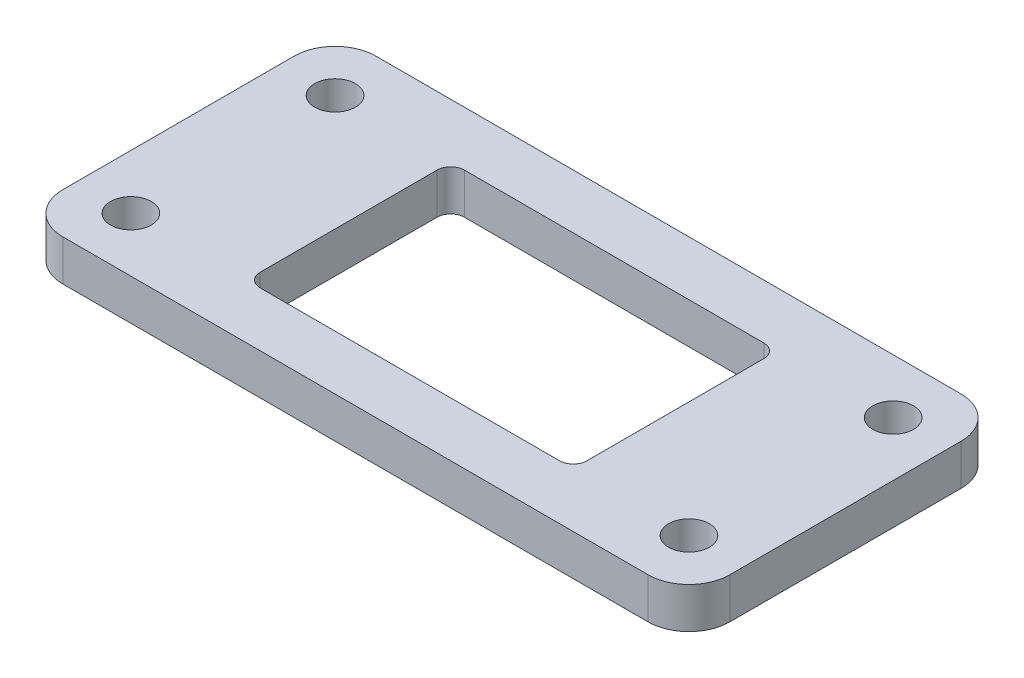
ISO-10303-21;
HEADER;
FILE_DESCRIPTION(('STEP AP214'),'2;1');
FILE_NAME('part.step','',(''),(''),'','','');
FILE_SCHEMA(('AUTOMOTIVE_DESIGN { 1 0 10303 214 1 1 1 1 }'));
ENDSEC;
DATA;
#1=APPLICATION_CONTEXT('core data for automotive mechanical design processes');
#2=APPLICATION_PROTOCOL_DEFINITION('international standard','automotive_design',2000,#1);
#3=PRODUCT_CONTEXT('',#1,'mechanical');
#4=PRODUCT('Part','Part','',(#3));
#5=PRODUCT_RELATED_PRODUCT_CATEGORY('part','',(#4));
#6=PRODUCT_DEFINITION_FORMATION('','',#4);
#7=PRODUCT_DEFINITION_CONTEXT('part definition',#1,'design');
#8=PRODUCT_DEFINITION('design','',#6,#7);
#9=PRODUCT_DEFINITION_SHAPE('','',#8);
#10=(LENGTH_UNIT() NAMED_UNIT(*) SI_UNIT(.MILLI.,.METRE.));
#11=(NAMED_UNIT(*) PLANE_ANGLE_UNIT() SI_UNIT($,.RADIAN.));
#12=(NAMED_UNIT(*) SI_UNIT($,.STERADIAN.) SOLID_ANGLE_UNIT());
#13=UNCERTAINTY_MEASURE_WITH_UNIT(LENGTH_MEASURE(1.E-05),#10,'distance_accuracy_value','');
#14=(GEOMETRIC_REPRESENTATION_CONTEXT(3) GLOBAL_UNCERTAINTY_ASSIGNED_CONTEXT((#13)) GLOBAL_UNIT_ASSIGNED_CONTEXT((#10,
#11,#12)) REPRESENTATION_CONTEXT('',''));
#15=CARTESIAN_POINT('',(0.,0.,0.));
#16=DIRECTION('',(0.,0.,1.));
#17=DIRECTION('',(1.,0.,0.));
#18=AXIS2_PLACEMENT_3D('',#15,#16,#17);
#19=CARTESIAN_POINT('',(-1.,3.,16.));
#20=DIRECTION('',(0.,-1.,0.));
#21=DIRECTION('',(0.,0.,-1.));
#22=AXIS2_PLACEMENT_3D('',#19,#20,#21);
#23=PLANE('',#22);
#24=CARTESIAN_POINT('',(0.,3.,15.));
#25=DIRECTION('',(0.,1.,0.));
#26=DIRECTION('',(0.,0.,1.));
#27=AXIS2_PLACEMENT_3D('',#24,#25,#26);
#28=CIRCLE('',#27,1.5);
#29=CARTESIAN_POINT('',(0.,3.,16.5));
#30=VERTEX_POINT('',#29);
#31=EDGE_CURVE('E210',#30,#30,#28,.T.);
#32=ORIENTED_EDGE('',*,*,#31,.F.);
#33=EDGE_LOOP('',(#32));
#34=FACE_BOUND('',#33,.T.);
#35=CARTESIAN_POINT('',(41.,3.,0.));
#36=DIRECTION('',(0.,1.,0.));
#37=DIRECTION('',(0.,0.,1.));
#38=AXIS2_PLACEMENT_3D('',#35,#36,#37);
#39=CIRCLE('',#38,1.5);
#40=CARTESIAN_POINT('',(41.,3.,1.5));
#41=VERTEX_POINT('',#40);
#42=EDGE_CURVE('E222',#41,#41,#39,.T.);
#43=ORIENTED_EDGE('',*,*,#42,.F.);
#44=EDGE_LOOP('',(#43));
#45=FACE_BOUND('',#44,.T.);
#46=CARTESIAN_POINT('',(-1.,3.,16.));
#47=DIRECTION('',(0.,1.,0.));
#48=DIRECTION('',(0.,0.,-1.));
#49=AXIS2_PLACEMENT_3D('',#46,#47,#48);
#50=CIRCLE('',#49,3.);
#51=CARTESIAN_POINT('',(-4.,3.,16.));
#52=VERTEX_POINT('',#51);
#53=CARTESIAN_POINT('',(-0.999999999999979,3.,19.));
#54=VERTEX_POINT('',#53);
#55=EDGE_CURVE('E234',#52,#54,#50,.T.);
#56=ORIENTED_EDGE('',*,*,#55,.T.);
#57=DIRECTION('',(1.,0.,0.));
#58=VECTOR('',#57,1.);
#59=CARTESIAN_POINT('',(-0.999999999999979,3.,19.));
#60=LINE('',#59,#58);
#61=CARTESIAN_POINT('',(42.,3.,19.));
#62=VERTEX_POINT('',#61);
#63=EDGE_CURVE('E237',#54,#62,#60,.T.);
#64=ORIENTED_EDGE('',*,*,#63,.T.);
#65=CARTESIAN_POINT('',(42.,3.,16.));
#66=DIRECTION('',(0.,1.,0.));
#67=DIRECTION('',(0.,0.,1.));
#68=AXIS2_PLACEMENT_3D('',#65,#66,#67);
#69=CIRCLE('',#68,3.);
#70=CARTESIAN_POINT('',(45.,3.,16.));
#71=VERTEX_POINT('',#70);
#72=EDGE_CURVE('E240',#62,#71,#69,.T.);
#73=ORIENTED_EDGE('',*,*,#72,.T.);
#74=DIRECTION('',(0.,0.,-1.));
#75=VECTOR('',#74,1.);
#76=CARTESIAN_POINT('',(45.,3.,-0.99999999999998));
#77=LINE('',#76,#75);
#78=CARTESIAN_POINT('',(45.,3.,-0.99999999999998));
#79=VERTEX_POINT('',#78);
#80=EDGE_CURVE('E242',#71,#79,#77,.T.);
#81=ORIENTED_EDGE('',*,*,#80,.T.);
#82=CARTESIAN_POINT('',(42.,3.,-1.));
#83=DIRECTION('',(0.,1.,0.));
#84=DIRECTION('',(0.,0.,-1.));
#85=AXIS2_PLACEMENT_3D('',#82,#83,#84);
#86=CIRCLE('',#85,3.);
#87=CARTESIAN_POINT('',(42.,3.,-4.));
#88=VERTEX_POINT('',#87);
#89=EDGE_CURVE('E244',#79,#88,#86,.T.);
#90=ORIENTED_EDGE('',*,*,#89,.T.);
#91=DIRECTION('',(-1.,0.,0.));
#92=VECTOR('',#91,1.);
#93=CARTESIAN_POINT('',(-0.999999999999979,3.,-4.));
#94=LINE('',#93,#92);
#95=CARTESIAN_POINT('',(-0.999999999999979,3.,-4.));
#96=VERTEX_POINT('',#95);
#97=EDGE_CURVE('E246',#88,#96,#94,.T.);
#98=ORIENTED_EDGE('',*,*,#97,.T.);
#99=CARTESIAN_POINT('',(-1.,3.,-1.));
#100=DIRECTION('',(0.,1.,0.));
#101=DIRECTION('',(0.,0.,1.));
#102=AXIS2_PLACEMENT_3D('',#99,#100,#101);
#103=CIRCLE('',#102,3.);
#104=CARTESIAN_POINT('',(-4.,3.,-0.999999999999979));
#105=VERTEX_POINT('',#104);
#106=EDGE_CURVE('E248',#96,#105,#103,.T.);
#107=ORIENTED_EDGE('',*,*,#106,.T.);
#108=DIRECTION('',(0.,0.,1.));
#109=VECTOR('',#108,1.);
#110=CARTESIAN_POINT('',(-4.,3.,-0.999999999999979));
#111=LINE('',#110,#109);
#112=EDGE_CURVE('E250',#105,#52,#111,.T.);
#113=ORIENTED_EDGE('',*,*,#112,.T.);
#114=EDGE_LOOP('',(#56,#64,#73,#81,#90,#98,#107,#113));
#115=FACE_BOUND('',#114,.T.);
#116=CARTESIAN_POINT('',(0.,3.,0.));
#117=DIRECTION('',(0.,1.,0.));
#118=DIRECTION('',(0.,0.,1.));
#119=AXIS2_PLACEMENT_3D('',#116,#117,#118);
#120=CIRCLE('',#119,1.5);
#121=CARTESIAN_POINT('',(0.,3.,1.5));
#122=VERTEX_POINT('',#121);
#123=EDGE_CURVE('E228',#122,#122,#120,.T.);
#124=ORIENTED_EDGE('',*,*,#123,.F.);
#125=EDGE_LOOP('',(#124));
#126=FACE_BOUND('',#125,.T.);
#127=CARTESIAN_POINT('',(41.,3.,15.));
#128=DIRECTION('',(0.,1.,0.));
#129=DIRECTION('',(0.,0.,1.));
#130=AXIS2_PLACEMENT_3D('',#127,#128,#129);
#131=CIRCLE('',#130,1.5);
#132=CARTESIAN_POINT('',(41.,3.,16.5));
#133=VERTEX_POINT('',#132);
#134=EDGE_CURVE('E216',#133,#133,#131,.T.);
#135=ORIENTED_EDGE('',*,*,#134,.F.);
#136=EDGE_LOOP('',(#135));
#137=FACE_BOUND('',#136,.T.);
#138=CARTESIAN_POINT('',(9.50000000000005,3.,14.));
#139=DIRECTION('',(0.,1.,0.));
#140=DIRECTION('',(0.,0.,1.));
#141=AXIS2_PLACEMENT_3D('',#138,#139,#140);
#142=CIRCLE('',#141,1.);
#143=CARTESIAN_POINT('',(8.50000000000005,3.,14.));
#144=VERTEX_POINT('',#143);
#145=CARTESIAN_POINT('',(9.50000000000006,3.,15.));
#146=VERTEX_POINT('',#145);
#147=EDGE_CURVE('E145',#144,#146,#142,.T.);
#148=ORIENTED_EDGE('',*,*,#147,.F.);
#149=DIRECTION('',(0.,0.,1.));
#150=VECTOR('',#149,1.);
#151=CARTESIAN_POINT('',(8.50000000000005,3.,1.00000000000001));
#152=LINE('',#151,#150);
#153=CARTESIAN_POINT('',(8.50000000000005,3.,1.00000000000001));
#154=VERTEX_POINT('',#153);
#155=EDGE_CURVE('E178',#154,#144,#152,.T.);
#156=ORIENTED_EDGE('',*,*,#155,.F.);
#157=CARTESIAN_POINT('',(9.50000000000005,3.,1.));
#158=DIRECTION('',(0.,1.,0.));
#159=DIRECTION('',(0.,0.,1.));
#160=AXIS2_PLACEMENT_3D('',#157,#158,#159);
#161=CIRCLE('',#160,1.);
#162=CARTESIAN_POINT('',(9.50000000000006,3.,0.));
#163=VERTEX_POINT('',#162);
#164=EDGE_CURVE('E176',#163,#154,#161,.T.);
#165=ORIENTED_EDGE('',*,*,#164,.F.);
#166=DIRECTION('',(-1.,0.,0.));
#167=VECTOR('',#166,1.);
#168=CARTESIAN_POINT('',(9.50000000000006,3.,0.));
#169=LINE('',#168,#167);
#170=CARTESIAN_POINT('',(31.5,3.,0.));
#171=VERTEX_POINT('',#170);
#172=EDGE_CURVE('E174',#171,#163,#169,.T.);
#173=ORIENTED_EDGE('',*,*,#172,.F.);
#174=CARTESIAN_POINT('',(31.5,3.,1.));
#175=DIRECTION('',(0.,1.,0.));
#176=DIRECTION('',(0.,0.,-1.));
#177=AXIS2_PLACEMENT_3D('',#174,#175,#176);
#178=CIRCLE('',#177,1.);
#179=CARTESIAN_POINT('',(32.5,3.,1.00000000000001));
#180=VERTEX_POINT('',#179);
#181=EDGE_CURVE('E172',#180,#171,#178,.T.);
#182=ORIENTED_EDGE('',*,*,#181,.F.);
#183=DIRECTION('',(0.,0.,-1.));
#184=VECTOR('',#183,1.);
#185=CARTESIAN_POINT('',(32.5,3.,1.00000000000001));
#186=LINE('',#185,#184);
#187=CARTESIAN_POINT('',(32.5,3.,14.));
#188=VERTEX_POINT('',#187);
#189=EDGE_CURVE('E168',#188,#180,#186,.T.);
#190=ORIENTED_EDGE('',*,*,#189,.F.);
#191=CARTESIAN_POINT('',(31.5,3.,14.));
#192=DIRECTION('',(0.,1.,0.));
#193=DIRECTION('',(0.,0.,1.));
#194=AXIS2_PLACEMENT_3D('',#191,#192,#193);
#195=CIRCLE('',#194,1.);
#196=CARTESIAN_POINT('',(31.5,3.,15.));
#197=VERTEX_POINT('',#196);
#198=EDGE_CURVE('E166',#197,#188,#195,.T.);
#199=ORIENTED_EDGE('',*,*,#198,.F.);
#200=DIRECTION('',(1.,0.,0.));
#201=VECTOR('',#200,1.);
#202=CARTESIAN_POINT('',(9.50000000000006,3.,15.));
#203=LINE('',#202,#201);
#204=EDGE_CURVE('E153',#146,#197,#203,.T.);
#205=ORIENTED_EDGE('',*,*,#204,.F.);
#206=EDGE_LOOP('',(#148,#156,#165,#173,#182,#190,#199,#205));
#207=FACE_BOUND('',#206,.T.);
#208=ADVANCED_FACE('F32',(#34,#45,#115,#126,#137,#207),#23,.F.);
#209=CARTESIAN_POINT('',(-1.,0.,16.));
#210=DIRECTION('',(0.,-1.,0.));
#211=DIRECTION('',(0.,0.,-1.));
#212=AXIS2_PLACEMENT_3D('',#209,#210,#211);
#213=PLANE('',#212);
#214=CARTESIAN_POINT('',(0.,0.,15.));
#215=DIRECTION('',(0.,1.,0.));
#216=DIRECTION('',(0.,0.,1.));
#217=AXIS2_PLACEMENT_3D('',#214,#215,#216);
#218=CIRCLE('',#217,1.5);
#219=CARTESIAN_POINT('',(0.,0.,16.5));
#220=VERTEX_POINT('',#219);
#221=EDGE_CURVE('E161',#220,#220,#218,.T.);
#222=ORIENTED_EDGE('',*,*,#221,.T.);
#223=EDGE_LOOP('',(#222));
#224=FACE_BOUND('',#223,.T.);
#225=CARTESIAN_POINT('',(41.,0.,0.));
#226=DIRECTION('',(0.,1.,0.));
#227=DIRECTION('',(0.,0.,1.));
#228=AXIS2_PLACEMENT_3D('',#225,#226,#227);
#229=CIRCLE('',#228,1.5);
#230=CARTESIAN_POINT('',(41.,0.,1.5));
#231=VERTEX_POINT('',#230);
#232=EDGE_CURVE('E219',#231,#231,#229,.T.);
#233=ORIENTED_EDGE('',*,*,#232,.T.);
#234=EDGE_LOOP('',(#233));
#235=FACE_BOUND('',#234,.T.);
#236=CARTESIAN_POINT('',(-1.,0.,16.));
#237=DIRECTION('',(0.,1.,0.));
#238=DIRECTION('',(0.,0.,-1.));
#239=AXIS2_PLACEMENT_3D('',#236,#237,#238);
#240=CIRCLE('',#239,3.);
#241=CARTESIAN_POINT('',(-4.,0.,16.));
#242=VERTEX_POINT('',#241);
#243=CARTESIAN_POINT('',(-0.999999999999979,0.,19.));
#244=VERTEX_POINT('',#243);
#245=EDGE_CURVE('E231',#242,#244,#240,.T.);
#246=ORIENTED_EDGE('',*,*,#245,.F.);
#247=DIRECTION('',(0.,0.,1.));
#248=VECTOR('',#247,1.);
#249=CARTESIAN_POINT('',(-4.,0.,-0.999999999999979));
#250=LINE('',#249,#248);
#251=CARTESIAN_POINT('',(-4.,0.,-0.999999999999979));
#252=VERTEX_POINT('',#251);
#253=EDGE_CURVE('E238',#252,#242,#250,.T.);
#254=ORIENTED_EDGE('',*,*,#253,.F.);
#255=CARTESIAN_POINT('',(-1.,0.,-1.));
#256=DIRECTION('',(0.,1.,0.));
#257=DIRECTION('',(0.,0.,1.));
#258=AXIS2_PLACEMENT_3D('',#255,#256,#257);
#259=CIRCLE('',#258,3.);
#260=CARTESIAN_POINT('',(-0.999999999999979,0.,-4.));
#261=VERTEX_POINT('',#260);
#262=EDGE_CURVE('E265',#261,#252,#259,.T.);
#263=ORIENTED_EDGE('',*,*,#262,.F.);
#264=DIRECTION('',(-1.,0.,0.));
#265=VECTOR('',#264,1.);
#266=CARTESIAN_POINT('',(-0.999999999999979,0.,-4.));
#267=LINE('',#266,#265);
#268=CARTESIAN_POINT('',(42.,0.,-4.));
#269=VERTEX_POINT('',#268);
#270=EDGE_CURVE('E263',#269,#261,#267,.T.);
#271=ORIENTED_EDGE('',*,*,#270,.F.);
#272=CARTESIAN_POINT('',(42.,0.,-1.));
#273=DIRECTION('',(0.,1.,0.));
#274=DIRECTION('',(0.,0.,-1.));
#275=AXIS2_PLACEMENT_3D('',#272,#273,#274);
#276=CIRCLE('',#275,3.);
#277=CARTESIAN_POINT('',(45.,0.,-0.99999999999998));
#278=VERTEX_POINT('',#277);
#279=EDGE_CURVE('E261',#278,#269,#276,.T.);
#280=ORIENTED_EDGE('',*,*,#279,.F.);
#281=DIRECTION('',(0.,0.,-1.));
#282=VECTOR('',#281,1.);
#283=CARTESIAN_POINT('',(45.,0.,-0.99999999999998));
#284=LINE('',#283,#282);
#285=CARTESIAN_POINT('',(45.,0.,16.));
#286=VERTEX_POINT('',#285);
#287=EDGE_CURVE('E259',#286,#278,#284,.T.);
#288=ORIENTED_EDGE('',*,*,#287,.F.);
#289=CARTESIAN_POINT('',(42.,0.,16.));
#290=DIRECTION('',(0.,1.,0.));
#291=DIRECTION('',(0.,0.,1.));
#292=AXIS2_PLACEMENT_3D('',#289,#290,#291);
#293=CIRCLE('',#292,3.);
#294=CARTESIAN_POINT('',(42.,0.,19.));
#295=VERTEX_POINT('',#294);
#296=EDGE_CURVE('E257',#295,#286,#293,.T.);
#297=ORIENTED_EDGE('',*,*,#296,.F.);
#298=DIRECTION('',(1.,0.,0.));
#299=VECTOR('',#298,1.);
#300=CARTESIAN_POINT('',(-0.999999999999979,0.,19.));
#301=LINE('',#300,#299);
#302=EDGE_CURVE('E255',#244,#295,#301,.T.);
#303=ORIENTED_EDGE('',*,*,#302,.F.);
#304=EDGE_LOOP('',(#246,#254,#263,#271,#280,#288,#297,#303));
#305=FACE_BOUND('',#304,.T.);
#306=CARTESIAN_POINT('',(0.,0.,0.));
#307=DIRECTION('',(0.,1.,0.));
#308=DIRECTION('',(0.,0.,1.));
#309=AXIS2_PLACEMENT_3D('',#306,#307,#308);
#310=CIRCLE('',#309,1.5);
#311=CARTESIAN_POINT('',(0.,0.,1.5));
#312=VERTEX_POINT('',#311);
#313=EDGE_CURVE('E225',#312,#312,#310,.T.);
#314=ORIENTED_EDGE('',*,*,#313,.T.);
#315=EDGE_LOOP('',(#314));
#316=FACE_BOUND('',#315,.T.);
#317=CARTESIAN_POINT('',(41.,0.,15.));
#318=DIRECTION('',(0.,1.,0.));
#319=DIRECTION('',(0.,0.,1.));
#320=AXIS2_PLACEMENT_3D('',#317,#318,#319);
#321=CIRCLE('',#320,1.5);
#322=CARTESIAN_POINT('',(41.,0.,16.5));
#323=VERTEX_POINT('',#322);
#324=EDGE_CURVE('E213',#323,#323,#321,.T.);
#325=ORIENTED_EDGE('',*,*,#324,.T.);
#326=EDGE_LOOP('',(#325));
#327=FACE_BOUND('',#326,.T.);
#328=DIRECTION('',(0.,0.,1.));
#329=VECTOR('',#328,1.);
#330=CARTESIAN_POINT('',(8.50000000000005,0.,1.00000000000001));
#331=LINE('',#330,#329);
#332=CARTESIAN_POINT('',(8.50000000000005,0.,1.00000000000001));
#333=VERTEX_POINT('',#332);
#334=CARTESIAN_POINT('',(8.50000000000005,0.,14.));
#335=VERTEX_POINT('',#334);
#336=EDGE_CURVE('E154',#333,#335,#331,.T.);
#337=ORIENTED_EDGE('',*,*,#336,.T.);
#338=CARTESIAN_POINT('',(9.50000000000005,0.,14.));
#339=DIRECTION('',(0.,1.,0.));
#340=DIRECTION('',(0.,0.,1.));
#341=AXIS2_PLACEMENT_3D('',#338,#339,#340);
#342=CIRCLE('',#341,1.);
#343=CARTESIAN_POINT('',(9.50000000000006,0.,15.));
#344=VERTEX_POINT('',#343);
#345=EDGE_CURVE('E55',#335,#344,#342,.T.);
#346=ORIENTED_EDGE('',*,*,#345,.T.);
#347=DIRECTION('',(1.,0.,0.));
#348=VECTOR('',#347,1.);
#349=CARTESIAN_POINT('',(15.8808233082704,0.,15.));
#350=LINE('',#349,#348);
#351=CARTESIAN_POINT('',(31.5,0.,15.));
#352=VERTEX_POINT('',#351);
#353=EDGE_CURVE('E160',#344,#352,#350,.T.);
#354=ORIENTED_EDGE('',*,*,#353,.T.);
#355=CARTESIAN_POINT('',(31.5,0.,14.));
#356=DIRECTION('',(0.,1.,0.));
#357=DIRECTION('',(0.,0.,1.));
#358=AXIS2_PLACEMENT_3D('',#355,#356,#357);
#359=CIRCLE('',#358,1.);
#360=CARTESIAN_POINT('',(32.5,0.,14.));
#361=VERTEX_POINT('',#360);
#362=EDGE_CURVE('E182',#352,#361,#359,.T.);
#363=ORIENTED_EDGE('',*,*,#362,.T.);
#364=DIRECTION('',(0.,0.,-1.));
#365=VECTOR('',#364,1.);
#366=CARTESIAN_POINT('',(32.5,0.,1.00000000000001));
#367=LINE('',#366,#365);
#368=CARTESIAN_POINT('',(32.5,0.,1.00000000000001));
#369=VERTEX_POINT('',#368);
#370=EDGE_CURVE('E185',#361,#369,#367,.T.);
#371=ORIENTED_EDGE('',*,*,#370,.T.);
#372=CARTESIAN_POINT('',(31.5,0.,1.));
#373=DIRECTION('',(0.,1.,0.));
#374=DIRECTION('',(0.,0.,-1.));
#375=AXIS2_PLACEMENT_3D('',#372,#373,#374);
#376=CIRCLE('',#375,1.);
#377=CARTESIAN_POINT('',(31.5,0.,0.));
#378=VERTEX_POINT('',#377);
#379=EDGE_CURVE('E188',#369,#378,#376,.T.);
#380=ORIENTED_EDGE('',*,*,#379,.T.);
#381=DIRECTION('',(-1.,0.,0.));
#382=VECTOR('',#381,1.);
#383=CARTESIAN_POINT('',(9.50000000000006,0.,0.));
#384=LINE('',#383,#382);
#385=CARTESIAN_POINT('',(9.50000000000006,0.,0.));
#386=VERTEX_POINT('',#385);
#387=EDGE_CURVE('E191',#378,#386,#384,.T.);
#388=ORIENTED_EDGE('',*,*,#387,.T.);
#389=CARTESIAN_POINT('',(9.50000000000005,0.,1.));
#390=DIRECTION('',(0.,1.,0.));
#391=DIRECTION('',(0.,0.,1.));
#392=AXIS2_PLACEMENT_3D('',#389,#390,#391);
#393=CIRCLE('',#392,1.);
#394=EDGE_CURVE('E194',#386,#333,#393,.T.);
#395=ORIENTED_EDGE('',*,*,#394,.T.);
#396=EDGE_LOOP('',(#337,#346,#354,#363,#371,#380,#388,#395));
#397=FACE_BOUND('',#396,.T.);
#398=ADVANCED_FACE('F295',(#224,#235,#305,#316,#327,#397),#213,.T.);
#399=CARTESIAN_POINT('',(-1.,3.,16.));
#400=DIRECTION('',(0.,-1.,0.));
#401=DIRECTION('',(0.,0.,-1.));
#402=AXIS2_PLACEMENT_3D('',#399,#400,#401);
#403=CYLINDRICAL_SURFACE('',#402,3.);
#404=ORIENTED_EDGE('',*,*,#245,.T.);
#405=DIRECTION('',(0.,-1.,0.));
#406=VECTOR('',#405,1.);
#407=CARTESIAN_POINT('',(-0.999999999999979,3.,19.));
#408=LINE('',#407,#406);
#409=EDGE_CURVE('E11',#54,#244,#408,.T.);
#410=ORIENTED_EDGE('',*,*,#409,.F.);
#411=ORIENTED_EDGE('',*,*,#55,.F.);
#412=DIRECTION('',(0.,-1.,0.));
#413=VECTOR('',#412,1.);
#414=CARTESIAN_POINT('',(-4.,3.,16.));
#415=LINE('',#414,#413);
#416=EDGE_CURVE('E252',#52,#242,#415,.T.);
#417=ORIENTED_EDGE('',*,*,#416,.T.);
#418=EDGE_LOOP('',(#404,#410,#411,#417));
#419=FACE_BOUND('',#418,.T.);
#420=ADVANCED_FACE('F34',(#419),#403,.T.);
#421=CARTESIAN_POINT('',(-0.999999999999979,3.,19.));
#422=DIRECTION('',(0.,0.,-1.));
#423=DIRECTION('',(-1.,0.,0.));
#424=AXIS2_PLACEMENT_3D('',#421,#422,#423);
#425=PLANE('',#424);
#426=ORIENTED_EDGE('',*,*,#302,.T.);
#427=DIRECTION('',(0.,-1.,0.));
#428=VECTOR('',#427,1.);
#429=CARTESIAN_POINT('',(42.,3.,19.));
#430=LINE('',#429,#428);
#431=EDGE_CURVE('E40',#62,#295,#430,.T.);
#432=ORIENTED_EDGE('',*,*,#431,.F.);
#433=ORIENTED_EDGE('',*,*,#63,.F.);
#434=ORIENTED_EDGE('',*,*,#409,.T.);
#435=EDGE_LOOP('',(#426,#432,#433,#434));
#436=FACE_BOUND('',#435,.T.);
#437=ADVANCED_FACE('F313',(#436),#425,.F.);
#438=CARTESIAN_POINT('',(42.,3.,16.));
#439=DIRECTION('',(0.,-1.,0.));
#440=DIRECTION('',(0.,0.,-1.));
#441=AXIS2_PLACEMENT_3D('',#438,#439,#440);
#442=CYLINDRICAL_SURFACE('',#441,3.);
#443=ORIENTED_EDGE('',*,*,#296,.T.);
#444=DIRECTION('',(0.,-1.,0.));
#445=VECTOR('',#444,1.);
#446=CARTESIAN_POINT('',(45.,3.,16.));
#447=LINE('',#446,#445);
#448=EDGE_CURVE('E282',#71,#286,#447,.T.);
#449=ORIENTED_EDGE('',*,*,#448,.F.);
#450=ORIENTED_EDGE('',*,*,#72,.F.);
#451=ORIENTED_EDGE('',*,*,#431,.T.);
#452=EDGE_LOOP('',(#443,#449,#450,#451));
#453=FACE_BOUND('',#452,.T.);
#454=ADVANCED_FACE('F289',(#453),#442,.T.);
#455=CARTESIAN_POINT('',(45.,3.,-0.99999999999998));
#456=DIRECTION('',(-1.,0.,0.));
#457=DIRECTION('',(0.,0.,1.));
#458=AXIS2_PLACEMENT_3D('',#455,#456,#457);
#459=PLANE('',#458);
#460=ORIENTED_EDGE('',*,*,#287,.T.);
#461=DIRECTION('',(0.,-1.,0.));
#462=VECTOR('',#461,1.);
#463=CARTESIAN_POINT('',(45.,3.,-0.99999999999998));
#464=LINE('',#463,#462);
#465=EDGE_CURVE('E279',#79,#278,#464,.T.);
#466=ORIENTED_EDGE('',*,*,#465,.F.);
#467=ORIENTED_EDGE('',*,*,#80,.F.);
#468=ORIENTED_EDGE('',*,*,#448,.T.);
#469=EDGE_LOOP('',(#460,#466,#467,#468));
#470=FACE_BOUND('',#469,.T.);
#471=ADVANCED_FACE('F301',(#470),#459,.F.);
#472=CARTESIAN_POINT('',(42.,3.,-1.));
#473=DIRECTION('',(0.,-1.,0.));
#474=DIRECTION('',(0.,0.,-1.));
#475=AXIS2_PLACEMENT_3D('',#472,#473,#474);
#476=CYLINDRICAL_SURFACE('',#475,3.);
#477=ORIENTED_EDGE('',*,*,#279,.T.);
#478=DIRECTION('',(0.,-1.,0.));
#479=VECTOR('',#478,1.);
#480=CARTESIAN_POINT('',(42.,3.,-4.));
#481=LINE('',#480,#479);
#482=EDGE_CURVE('E276',#88,#269,#481,.T.);
#483=ORIENTED_EDGE('',*,*,#482,.F.);
#484=ORIENTED_EDGE('',*,*,#89,.F.);
#485=ORIENTED_EDGE('',*,*,#465,.T.);
#486=EDGE_LOOP('',(#477,#483,#484,#485));
#487=FACE_BOUND('',#486,.T.);
#488=ADVANCED_FACE('F305',(#487),#476,.T.);
#489=CARTESIAN_POINT('',(-0.999999999999979,3.,-4.));
#490=DIRECTION('',(0.,0.,1.));
#491=DIRECTION('',(1.,0.,0.));
#492=AXIS2_PLACEMENT_3D('',#489,#490,#491);
#493=PLANE('',#492);
#494=ORIENTED_EDGE('',*,*,#270,.T.);
#495=DIRECTION('',(0.,-1.,0.));
#496=VECTOR('',#495,1.);
#497=CARTESIAN_POINT('',(-0.999999999999979,3.,-4.));
#498=LINE('',#497,#496);
#499=EDGE_CURVE('E273',#96,#261,#498,.T.);
#500=ORIENTED_EDGE('',*,*,#499,.F.);
#501=ORIENTED_EDGE('',*,*,#97,.F.);
#502=ORIENTED_EDGE('',*,*,#482,.T.);
#503=EDGE_LOOP('',(#494,#500,#501,#502));
#504=FACE_BOUND('',#503,.T.);
#505=ADVANCED_FACE('F326',(#504),#493,.F.);
#506=CARTESIAN_POINT('',(-1.,3.,-1.));
#507=DIRECTION('',(0.,-1.,0.));
#508=DIRECTION('',(0.,0.,-1.));
#509=AXIS2_PLACEMENT_3D('',#506,#507,#508);
#510=CYLINDRICAL_SURFACE('',#509,3.);
#511=ORIENTED_EDGE('',*,*,#262,.T.);
#512=DIRECTION('',(0.,-1.,0.));
#513=VECTOR('',#512,1.);
#514=CARTESIAN_POINT('',(-4.,3.,-0.999999999999979));
#515=LINE('',#514,#513);
#516=EDGE_CURVE('E270',#105,#252,#515,.T.);
#517=ORIENTED_EDGE('',*,*,#516,.F.);
#518=ORIENTED_EDGE('',*,*,#106,.F.);
#519=ORIENTED_EDGE('',*,*,#499,.T.);
#520=EDGE_LOOP('',(#511,#517,#518,#519));
#521=FACE_BOUND('',#520,.T.);
#522=ADVANCED_FACE('F324',(#521),#510,.T.);
#523=CARTESIAN_POINT('',(-4.,3.,-0.999999999999979));
#524=DIRECTION('',(1.,0.,0.));
#525=DIRECTION('',(0.,0.,-1.));
#526=AXIS2_PLACEMENT_3D('',#523,#524,#525);
#527=PLANE('',#526);
#528=ORIENTED_EDGE('',*,*,#253,.T.);
#529=ORIENTED_EDGE('',*,*,#416,.F.);
#530=ORIENTED_EDGE('',*,*,#112,.F.);
#531=ORIENTED_EDGE('',*,*,#516,.T.);
#532=EDGE_LOOP('',(#528,#529,#530,#531));
#533=FACE_BOUND('',#532,.T.);
#534=ADVANCED_FACE('F319',(#533),#527,.F.);
#535=CARTESIAN_POINT('',(0.,3.,0.));
#536=DIRECTION('',(0.,-1.,0.));
#537=DIRECTION('',(0.,0.,-1.));
#538=AXIS2_PLACEMENT_3D('',#535,#536,#537);
#539=CYLINDRICAL_SURFACE('',#538,1.5);
#540=ORIENTED_EDGE('',*,*,#123,.T.);
#541=EDGE_LOOP('',(#540));
#542=FACE_BOUND('',#541,.T.);
#543=ORIENTED_EDGE('',*,*,#313,.F.);
#544=EDGE_LOOP('',(#543));
#545=FACE_BOUND('',#544,.T.);
#546=ADVANCED_FACE('F346',(#542,#545),#539,.F.);
#547=CARTESIAN_POINT('',(41.,3.,0.));
#548=DIRECTION('',(0.,-1.,0.));
#549=DIRECTION('',(0.,0.,-1.));
#550=AXIS2_PLACEMENT_3D('',#547,#548,#549);
#551=CYLINDRICAL_SURFACE('',#550,1.5);
#552=ORIENTED_EDGE('',*,*,#42,.T.);
#553=EDGE_LOOP('',(#552));
#554=FACE_BOUND('',#553,.T.);
#555=ORIENTED_EDGE('',*,*,#232,.F.);
#556=EDGE_LOOP('',(#555));
#557=FACE_BOUND('',#556,.T.);
#558=ADVANCED_FACE('F353',(#554,#557),#551,.F.);
#559=CARTESIAN_POINT('',(41.,3.,15.));
#560=DIRECTION('',(0.,-1.,0.));
#561=DIRECTION('',(0.,0.,-1.));
#562=AXIS2_PLACEMENT_3D('',#559,#560,#561);
#563=CYLINDRICAL_SURFACE('',#562,1.5);
#564=ORIENTED_EDGE('',*,*,#134,.T.);
#565=EDGE_LOOP('',(#564));
#566=FACE_BOUND('',#565,.T.);
#567=ORIENTED_EDGE('',*,*,#324,.F.);
#568=EDGE_LOOP('',(#567));
#569=FACE_BOUND('',#568,.T.);
#570=ADVANCED_FACE('F358',(#566,#569),#563,.F.);
#571=CARTESIAN_POINT('',(0.,3.,15.));
#572=DIRECTION('',(0.,-1.,0.));
#573=DIRECTION('',(0.,0.,-1.));
#574=AXIS2_PLACEMENT_3D('',#571,#572,#573);
#575=CYLINDRICAL_SURFACE('',#574,1.5);
#576=ORIENTED_EDGE('',*,*,#31,.T.);
#577=EDGE_LOOP('',(#576));
#578=FACE_BOUND('',#577,.T.);
#579=ORIENTED_EDGE('',*,*,#221,.F.);
#580=EDGE_LOOP('',(#579));
#581=FACE_BOUND('',#580,.T.);
#582=ADVANCED_FACE('F401',(#578,#581),#575,.F.);
#583=CARTESIAN_POINT('',(9.50000000000005,3.,14.));
#584=DIRECTION('',(0.,-1.,0.));
#585=DIRECTION('',(0.,0.,-1.));
#586=AXIS2_PLACEMENT_3D('',#583,#584,#585);
#587=CYLINDRICAL_SURFACE('',#586,1.);
#588=ORIENTED_EDGE('',*,*,#345,.F.);
#589=DIRECTION('',(0.,-1.,0.));
#590=VECTOR('',#589,1.);
#591=CARTESIAN_POINT('',(8.50000000000005,3.,14.));
#592=LINE('',#591,#590);
#593=EDGE_CURVE('E149',#144,#335,#592,.T.);
#594=ORIENTED_EDGE('',*,*,#593,.F.);
#595=ORIENTED_EDGE('',*,*,#147,.T.);
#596=DIRECTION('',(0.,-1.,0.));
#597=VECTOR('',#596,1.);
#598=CARTESIAN_POINT('',(9.50000000000006,3.,15.));
#599=LINE('',#598,#597);
#600=EDGE_CURVE('E148',#146,#344,#599,.T.);
#601=ORIENTED_EDGE('',*,*,#600,.T.);
#602=EDGE_LOOP('',(#588,#594,#595,#601));
#603=FACE_BOUND('',#602,.T.);
#604=ADVANCED_FACE('F147',(#603),#587,.F.);
#605=CARTESIAN_POINT('',(15.8808233082704,3.,15.));
#606=DIRECTION('',(0.,0.,-1.));
#607=DIRECTION('',(-1.,0.,0.));
#608=AXIS2_PLACEMENT_3D('',#605,#606,#607);
#609=PLANE('',#608);
#610=ORIENTED_EDGE('',*,*,#353,.F.);
#611=ORIENTED_EDGE('',*,*,#600,.F.);
#612=ORIENTED_EDGE('',*,*,#204,.T.);
#613=DIRECTION('',(0.,-1.,0.));
#614=VECTOR('',#613,1.);
#615=CARTESIAN_POINT('',(31.5,3.,15.));
#616=LINE('',#615,#614);
#617=EDGE_CURVE('E162',#197,#352,#616,.T.);
#618=ORIENTED_EDGE('',*,*,#617,.T.);
#619=EDGE_LOOP('',(#610,#611,#612,#618));
#620=FACE_BOUND('',#619,.T.);
#621=ADVANCED_FACE('F157',(#620),#609,.T.);
#622=CARTESIAN_POINT('',(31.5,3.,14.));
#623=DIRECTION('',(0.,-1.,0.));
#624=DIRECTION('',(0.,0.,-1.));
#625=AXIS2_PLACEMENT_3D('',#622,#623,#624);
#626=CYLINDRICAL_SURFACE('',#625,1.);
#627=ORIENTED_EDGE('',*,*,#362,.F.);
#628=ORIENTED_EDGE('',*,*,#617,.F.);
#629=ORIENTED_EDGE('',*,*,#198,.T.);
#630=DIRECTION('',(0.,-1.,0.));
#631=VECTOR('',#630,1.);
#632=CARTESIAN_POINT('',(32.5,3.,14.));
#633=LINE('',#632,#631);
#634=EDGE_CURVE('E207',#188,#361,#633,.T.);
#635=ORIENTED_EDGE('',*,*,#634,.T.);
#636=EDGE_LOOP('',(#627,#628,#629,#635));
#637=FACE_BOUND('',#636,.T.);
#638=ADVANCED_FACE('F388',(#637),#626,.F.);
#639=CARTESIAN_POINT('',(32.5,3.,1.00000000000001));
#640=DIRECTION('',(-1.,0.,0.));
#641=DIRECTION('',(0.,0.,1.));
#642=AXIS2_PLACEMENT_3D('',#639,#640,#641);
#643=PLANE('',#642);
#644=ORIENTED_EDGE('',*,*,#370,.F.);
#645=ORIENTED_EDGE('',*,*,#634,.F.);
#646=ORIENTED_EDGE('',*,*,#189,.T.);
#647=DIRECTION('',(0.,-1.,0.));
#648=VECTOR('',#647,1.);
#649=CARTESIAN_POINT('',(32.5,3.,1.00000000000001));
#650=LINE('',#649,#648);
#651=EDGE_CURVE('E205',#180,#369,#650,.T.);
#652=ORIENTED_EDGE('',*,*,#651,.T.);
#653=EDGE_LOOP('',(#644,#645,#646,#652));
#654=FACE_BOUND('',#653,.T.);
#655=ADVANCED_FACE('F385',(#654),#643,.T.);
#656=CARTESIAN_POINT('',(31.5,3.,1.));
#657=DIRECTION('',(0.,-1.,0.));
#658=DIRECTION('',(0.,0.,-1.));
#659=AXIS2_PLACEMENT_3D('',#656,#657,#658);
#660=CYLINDRICAL_SURFACE('',#659,1.);
#661=ORIENTED_EDGE('',*,*,#379,.F.);
#662=ORIENTED_EDGE('',*,*,#651,.F.);
#663=ORIENTED_EDGE('',*,*,#181,.T.);
#664=DIRECTION('',(0.,-1.,0.));
#665=VECTOR('',#664,1.);
#666=CARTESIAN_POINT('',(31.5,3.,0.));
#667=LINE('',#666,#665);
#668=EDGE_CURVE('E203',#171,#378,#667,.T.);
#669=ORIENTED_EDGE('',*,*,#668,.T.);
#670=EDGE_LOOP('',(#661,#662,#663,#669));
#671=FACE_BOUND('',#670,.T.);
#672=ADVANCED_FACE('F380',(#671),#660,.F.);
#673=CARTESIAN_POINT('',(9.50000000000006,3.,0.));
#674=DIRECTION('',(0.,0.,1.));
#675=DIRECTION('',(1.,0.,0.));
#676=AXIS2_PLACEMENT_3D('',#673,#674,#675);
#677=PLANE('',#676);
#678=ORIENTED_EDGE('',*,*,#387,.F.);
#679=ORIENTED_EDGE('',*,*,#668,.F.);
#680=ORIENTED_EDGE('',*,*,#172,.T.);
#681=DIRECTION('',(0.,-1.,0.));
#682=VECTOR('',#681,1.);
#683=CARTESIAN_POINT('',(9.50000000000006,3.,0.));
#684=LINE('',#683,#682);
#685=EDGE_CURVE('E201',#163,#386,#684,.T.);
#686=ORIENTED_EDGE('',*,*,#685,.T.);
#687=EDGE_LOOP('',(#678,#679,#680,#686));
#688=FACE_BOUND('',#687,.T.);
#689=ADVANCED_FACE('F376',(#688),#677,.T.);
#690=CARTESIAN_POINT('',(9.50000000000005,3.,1.));
#691=DIRECTION('',(0.,-1.,0.));
#692=DIRECTION('',(0.,0.,-1.));
#693=AXIS2_PLACEMENT_3D('',#690,#691,#692);
#694=CYLINDRICAL_SURFACE('',#693,1.);
#695=ORIENTED_EDGE('',*,*,#394,.F.);
#696=ORIENTED_EDGE('',*,*,#685,.F.);
#697=ORIENTED_EDGE('',*,*,#164,.T.);
#698=DIRECTION('',(0.,-1.,0.));
#699=VECTOR('',#698,1.);
#700=CARTESIAN_POINT('',(8.50000000000005,3.,1.00000000000001));
#701=LINE('',#700,#699);
#702=EDGE_CURVE('E47',#154,#333,#701,.T.);
#703=ORIENTED_EDGE('',*,*,#702,.T.);
#704=EDGE_LOOP('',(#695,#696,#697,#703));
#705=FACE_BOUND('',#704,.T.);
#706=ADVANCED_FACE('F373',(#705),#694,.F.);
#707=CARTESIAN_POINT('',(8.50000000000005,3.,1.00000000000001));
#708=DIRECTION('',(1.,0.,0.));
#709=DIRECTION('',(0.,0.,-1.));
#710=AXIS2_PLACEMENT_3D('',#707,#708,#709);
#711=PLANE('',#710);
#712=ORIENTED_EDGE('',*,*,#336,.F.);
#713=ORIENTED_EDGE('',*,*,#702,.F.);
#714=ORIENTED_EDGE('',*,*,#155,.T.);
#715=ORIENTED_EDGE('',*,*,#593,.T.);
#716=EDGE_LOOP('',(#712,#713,#714,#715));
#717=FACE_BOUND('',#716,.T.);
#718=ADVANCED_FACE('F367',(#717),#711,.T.);
#719=CLOSED_SHELL('',(#208,#398,#420,#437,#454,#471,#488,#505,#522,#534,#546,#558,#570,#582,
#604,#621,#638,#655,#672,#689,#706,#718));
#720=MANIFOLD_SOLID_BREP('B2',#719);
#721=ADVANCED_BREP_SHAPE_REPRESENTATION('',(#18,#720),#14);
#722=SHAPE_DEFINITION_REPRESENTATION(#9,#721);
ENDSEC;
END-ISO-10303-21;
